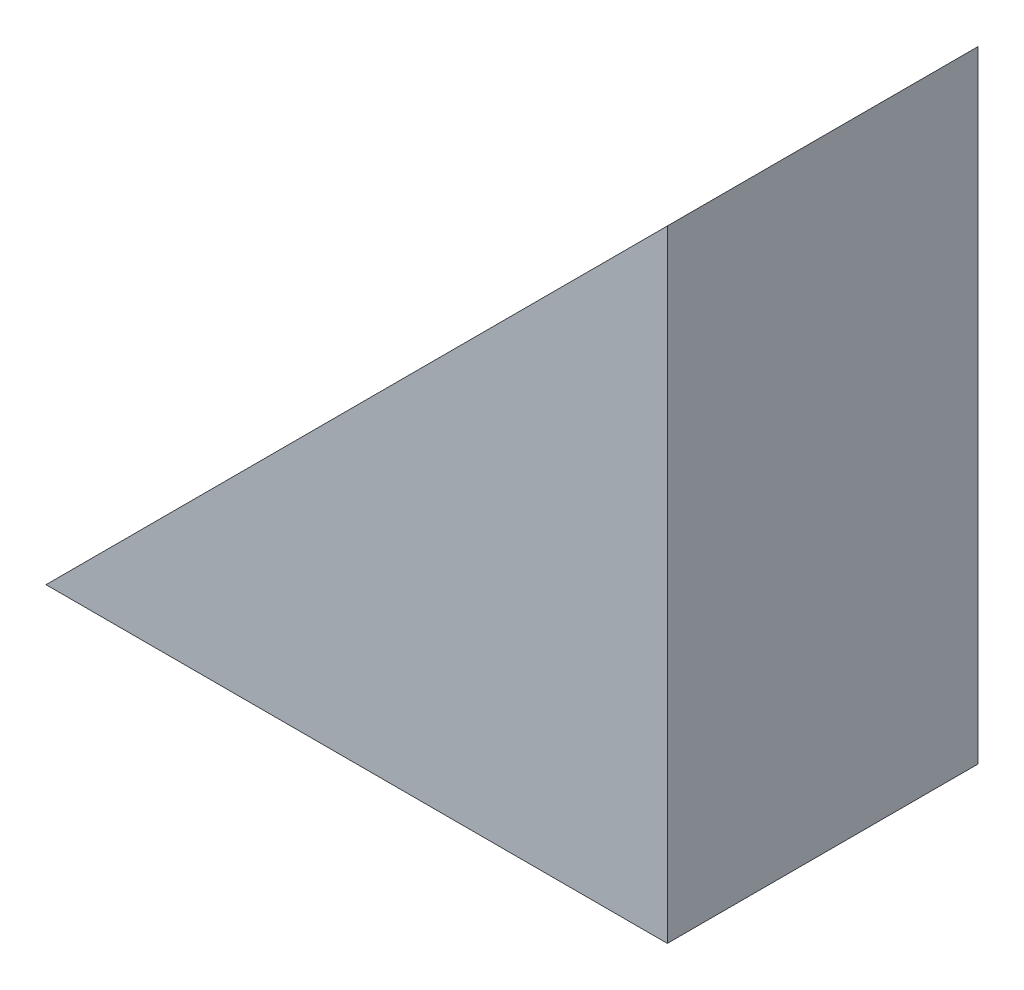
ISO-10303-21;
HEADER;
FILE_DESCRIPTION(('STEP AP214'),'2;1');
FILE_NAME('part.step','',(''),(''),'','','');
FILE_SCHEMA(('AUTOMOTIVE_DESIGN { 1 0 10303 214 1 1 1 1 }'));
ENDSEC;
DATA;
#1=APPLICATION_CONTEXT('core data for automotive mechanical design processes');
#2=APPLICATION_PROTOCOL_DEFINITION('international standard','automotive_design',2000,#1);
#3=PRODUCT_CONTEXT('',#1,'mechanical');
#4=PRODUCT('Part','Part','',(#3));
#5=PRODUCT_RELATED_PRODUCT_CATEGORY('part','',(#4));
#6=PRODUCT_DEFINITION_FORMATION('','',#4);
#7=PRODUCT_DEFINITION_CONTEXT('part definition',#1,'design');
#8=PRODUCT_DEFINITION('design','',#6,#7);
#9=PRODUCT_DEFINITION_SHAPE('','',#8);
#10=(LENGTH_UNIT() NAMED_UNIT(*) SI_UNIT(.MILLI.,.METRE.));
#11=(NAMED_UNIT(*) PLANE_ANGLE_UNIT() SI_UNIT($,.RADIAN.));
#12=(NAMED_UNIT(*) SI_UNIT($,.STERADIAN.) SOLID_ANGLE_UNIT());
#13=UNCERTAINTY_MEASURE_WITH_UNIT(LENGTH_MEASURE(1.E-05),#10,'distance_accuracy_value','');
#14=(GEOMETRIC_REPRESENTATION_CONTEXT(3) GLOBAL_UNCERTAINTY_ASSIGNED_CONTEXT((#13)) GLOBAL_UNIT_ASSIGNED_CONTEXT((#10,
#11,#12)) REPRESENTATION_CONTEXT('',''));
#15=CARTESIAN_POINT('',(0.,0.,0.));
#16=DIRECTION('',(0.,0.,1.));
#17=DIRECTION('',(1.,0.,0.));
#18=AXIS2_PLACEMENT_3D('',#15,#16,#17);
#19=CARTESIAN_POINT('',(-20.,0.,10.));
#20=DIRECTION('',(0.,1.,0.));
#21=DIRECTION('',(0.,0.,1.));
#22=AXIS2_PLACEMENT_3D('',#19,#20,#21);
#23=PLANE('',#22);
#24=DIRECTION('',(1.,0.,0.));
#25=VECTOR('',#24,1.);
#26=CARTESIAN_POINT('',(-20.,0.,0.));
#27=LINE('',#26,#25);
#28=CARTESIAN_POINT('',(-20.,0.,0.));
#29=VERTEX_POINT('',#28);
#30=CARTESIAN_POINT('',(0.,0.,0.));
#31=VERTEX_POINT('',#30);
#32=EDGE_CURVE('E89',#29,#31,#27,.T.);
#33=ORIENTED_EDGE('',*,*,#32,.T.);
#34=DIRECTION('',(0.,0.,-1.));
#35=VECTOR('',#34,1.);
#36=CARTESIAN_POINT('',(0.,0.,10.));
#37=LINE('',#36,#35);
#38=CARTESIAN_POINT('',(0.,0.,10.));
#39=VERTEX_POINT('',#38);
#40=EDGE_CURVE('E11',#39,#31,#37,.T.);
#41=ORIENTED_EDGE('',*,*,#40,.F.);
#42=DIRECTION('',(1.,0.,0.));
#43=VECTOR('',#42,1.);
#44=CARTESIAN_POINT('',(-20.,0.,10.));
#45=LINE('',#44,#43);
#46=CARTESIAN_POINT('',(-20.,0.,10.));
#47=VERTEX_POINT('',#46);
#48=EDGE_CURVE('E81',#47,#39,#45,.T.);
#49=ORIENTED_EDGE('',*,*,#48,.F.);
#50=DIRECTION('',(0.,0.,-1.));
#51=VECTOR('',#50,1.);
#52=CARTESIAN_POINT('',(-20.,0.,10.));
#53=LINE('',#52,#51);
#54=EDGE_CURVE('E90',#47,#29,#53,.T.);
#55=ORIENTED_EDGE('',*,*,#54,.T.);
#56=EDGE_LOOP('',(#33,#41,#49,#55));
#57=FACE_BOUND('',#56,.T.);
#58=ADVANCED_FACE('F39',(#57),#23,.F.);
#59=CARTESIAN_POINT('',(0.,0.,10.));
#60=DIRECTION('',(-1.,0.,0.));
#61=DIRECTION('',(0.,0.,1.));
#62=AXIS2_PLACEMENT_3D('',#59,#60,#61);
#63=PLANE('',#62);
#64=DIRECTION('',(0.,1.,0.));
#65=VECTOR('',#64,1.);
#66=CARTESIAN_POINT('',(0.,0.,0.));
#67=LINE('',#66,#65);
#68=CARTESIAN_POINT('',(0.,20.,0.));
#69=VERTEX_POINT('',#68);
#70=EDGE_CURVE('E68',#31,#69,#67,.T.);
#71=ORIENTED_EDGE('',*,*,#70,.T.);
#72=DIRECTION('',(0.,0.,-1.));
#73=VECTOR('',#72,1.);
#74=CARTESIAN_POINT('',(0.,20.,10.));
#75=LINE('',#74,#73);
#76=CARTESIAN_POINT('',(0.,20.,10.));
#77=VERTEX_POINT('',#76);
#78=EDGE_CURVE('E48',#77,#69,#75,.T.);
#79=ORIENTED_EDGE('',*,*,#78,.F.);
#80=DIRECTION('',(0.,1.,0.));
#81=VECTOR('',#80,1.);
#82=CARTESIAN_POINT('',(0.,0.,10.));
#83=LINE('',#82,#81);
#84=EDGE_CURVE('E76',#39,#77,#83,.T.);
#85=ORIENTED_EDGE('',*,*,#84,.F.);
#86=ORIENTED_EDGE('',*,*,#40,.T.);
#87=EDGE_LOOP('',(#71,#79,#85,#86));
#88=FACE_BOUND('',#87,.T.);
#89=ADVANCED_FACE('F77',(#88),#63,.F.);
#90=CARTESIAN_POINT('',(0.,20.,10.));
#91=DIRECTION('',(0.707106781186548,-0.707106781186548,0.));
#92=DIRECTION('',(0.707106781186548,0.707106781186548,0.));
#93=AXIS2_PLACEMENT_3D('',#90,#91,#92);
#94=PLANE('',#93);
#95=DIRECTION('',(-0.707106781186548,-0.707106781186548,0.));
#96=VECTOR('',#95,1.);
#97=CARTESIAN_POINT('',(0.,20.,0.));
#98=LINE('',#97,#96);
#99=EDGE_CURVE('E73',#69,#29,#98,.T.);
#100=ORIENTED_EDGE('',*,*,#99,.T.);
#101=ORIENTED_EDGE('',*,*,#54,.F.);
#102=DIRECTION('',(-0.707106781186548,-0.707106781186548,0.));
#103=VECTOR('',#102,1.);
#104=CARTESIAN_POINT('',(0.,20.,10.));
#105=LINE('',#104,#103);
#106=EDGE_CURVE('E56',#77,#47,#105,.T.);
#107=ORIENTED_EDGE('',*,*,#106,.F.);
#108=ORIENTED_EDGE('',*,*,#78,.T.);
#109=EDGE_LOOP('',(#100,#101,#107,#108));
#110=FACE_BOUND('',#109,.T.);
#111=ADVANCED_FACE('F102',(#110),#94,.F.);
#112=CARTESIAN_POINT('',(0.,0.,10.));
#113=DIRECTION('',(0.,0.,1.));
#114=DIRECTION('',(1.,0.,0.));
#115=AXIS2_PLACEMENT_3D('',#112,#113,#114);
#116=PLANE('',#115);
#117=ORIENTED_EDGE('',*,*,#48,.T.);
#118=ORIENTED_EDGE('',*,*,#84,.T.);
#119=ORIENTED_EDGE('',*,*,#106,.T.);
#120=EDGE_LOOP('',(#117,#118,#119));
#121=FACE_BOUND('',#120,.T.);
#122=ADVANCED_FACE('F84',(#121),#116,.T.);
#123=CARTESIAN_POINT('',(0.,0.,0.));
#124=DIRECTION('',(0.,0.,1.));
#125=DIRECTION('',(1.,0.,0.));
#126=AXIS2_PLACEMENT_3D('',#123,#124,#125);
#127=PLANE('',#126);
#128=ORIENTED_EDGE('',*,*,#32,.F.);
#129=ORIENTED_EDGE('',*,*,#99,.F.);
#130=ORIENTED_EDGE('',*,*,#70,.F.);
#131=EDGE_LOOP('',(#128,#129,#130));
#132=FACE_BOUND('',#131,.T.);
#133=ADVANCED_FACE('F103',(#132),#127,.F.);
#134=CLOSED_SHELL('',(#58,#89,#111,#122,#133));
#135=MANIFOLD_SOLID_BREP('B2',#134);
#136=ADVANCED_BREP_SHAPE_REPRESENTATION('',(#18,#135),#14);
#137=SHAPE_DEFINITION_REPRESENTATION(#9,#136);
ENDSEC;
END-ISO-10303-21;
